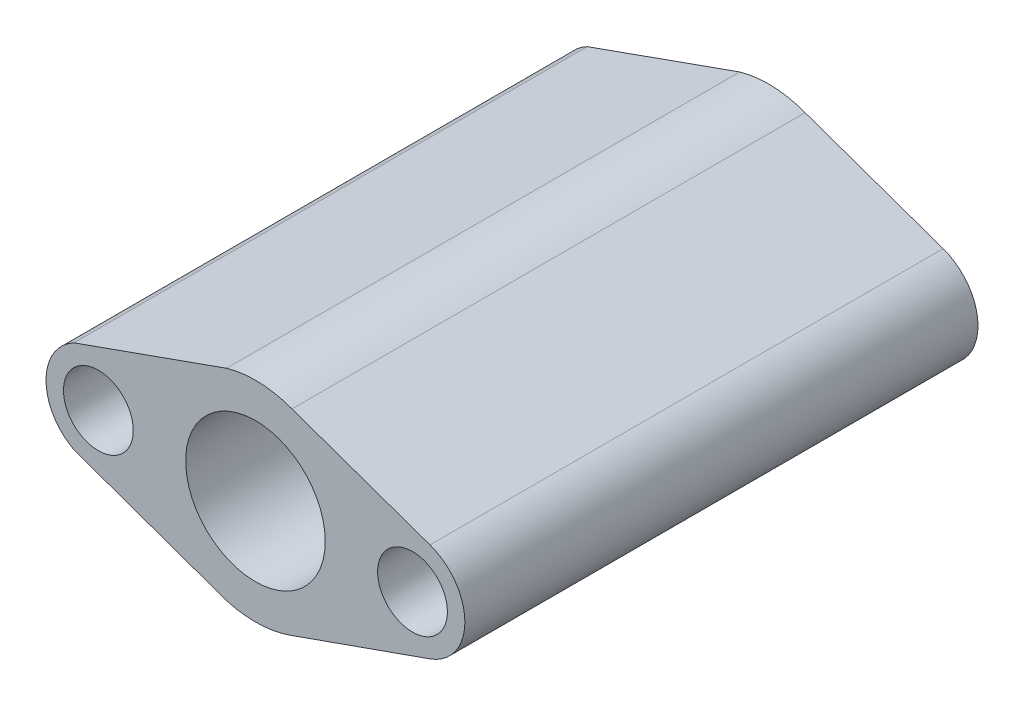
ISO-10303-21;
HEADER;
FILE_DESCRIPTION(('STEP AP214'),'2;1');
FILE_NAME('part.step','',(''),(''),'','','');
FILE_SCHEMA(('AUTOMOTIVE_DESIGN { 1 0 10303 214 1 1 1 1 }'));
ENDSEC;
DATA;
#1=APPLICATION_CONTEXT('core data for automotive mechanical design processes');
#2=APPLICATION_PROTOCOL_DEFINITION('international standard','automotive_design',2000,#1);
#3=PRODUCT_CONTEXT('',#1,'mechanical');
#4=PRODUCT('Part','Part','',(#3));
#5=PRODUCT_RELATED_PRODUCT_CATEGORY('part','',(#4));
#6=PRODUCT_DEFINITION_FORMATION('','',#4);
#7=PRODUCT_DEFINITION_CONTEXT('part definition',#1,'design');
#8=PRODUCT_DEFINITION('design','',#6,#7);
#9=PRODUCT_DEFINITION_SHAPE('','',#8);
#10=(LENGTH_UNIT() NAMED_UNIT(*) SI_UNIT(.MILLI.,.METRE.));
#11=(NAMED_UNIT(*) PLANE_ANGLE_UNIT() SI_UNIT($,.RADIAN.));
#12=(NAMED_UNIT(*) SI_UNIT($,.STERADIAN.) SOLID_ANGLE_UNIT());
#13=UNCERTAINTY_MEASURE_WITH_UNIT(LENGTH_MEASURE(1.E-05),#10,'distance_accuracy_value','');
#14=(GEOMETRIC_REPRESENTATION_CONTEXT(3) GLOBAL_UNCERTAINTY_ASSIGNED_CONTEXT((#13)) GLOBAL_UNIT_ASSIGNED_CONTEXT((#10,
#11,#12)) REPRESENTATION_CONTEXT('',''));
#15=CARTESIAN_POINT('',(0.,0.,0.));
#16=DIRECTION('',(0.,0.,1.));
#17=DIRECTION('',(1.,0.,0.));
#18=AXIS2_PLACEMENT_3D('',#15,#16,#17);
#19=CARTESIAN_POINT('',(23.7236194650575,67.1226286375755,-147.));
#20=DIRECTION('',(-0.333235773660931,-0.942843528456658,0.));
#21=DIRECTION('',(0.942843528456658,-0.333235773660931,0.));
#22=AXIS2_PLACEMENT_3D('',#19,#20,#21);
#23=PLANE('',#22);
#24=DIRECTION('',(0.942843528456658,-0.333235773660931,0.));
#25=VECTOR('',#24,1.);
#26=CARTESIAN_POINT('',(23.7236194650575,67.1226286375755,0.));
#27=LINE('',#26,#25);
#28=CARTESIAN_POINT('',(-36.5083849314917,88.4108466487737,0.));
#29=VERTEX_POINT('',#28);
#30=CARTESIAN_POINT('',(3.01065796299276,74.4433552932996,0.));
#31=VERTEX_POINT('',#30);
#32=EDGE_CURVE('E157',#29,#31,#27,.T.);
#33=ORIENTED_EDGE('',*,*,#32,.T.);
#34=DIRECTION('',(0.,0.,1.));
#35=VECTOR('',#34,1.);
#36=CARTESIAN_POINT('',(3.01065796299276,74.4433552932996,-147.));
#37=LINE('',#36,#35);
#38=CARTESIAN_POINT('',(3.01065796299276,74.4433552932996,-147.));
#39=VERTEX_POINT('',#38);
#40=EDGE_CURVE('E11',#39,#31,#37,.T.);
#41=ORIENTED_EDGE('',*,*,#40,.F.);
#42=DIRECTION('',(0.942843528456658,-0.333235773660931,0.));
#43=VECTOR('',#42,1.);
#44=CARTESIAN_POINT('',(23.7236194650575,67.1226286375755,-147.));
#45=LINE('',#44,#43);
#46=CARTESIAN_POINT('',(-36.5083849314917,88.4108466487737,-147.));
#47=VERTEX_POINT('',#46);
#48=EDGE_CURVE('E61',#47,#39,#45,.T.);
#49=ORIENTED_EDGE('',*,*,#48,.F.);
#50=DIRECTION('',(0.,0.,1.));
#51=VECTOR('',#50,1.);
#52=CARTESIAN_POINT('',(-36.5083849314917,88.4108466487737,-147.));
#53=LINE('',#52,#51);
#54=EDGE_CURVE('E45',#47,#29,#53,.T.);
#55=ORIENTED_EDGE('',*,*,#54,.T.);
#56=EDGE_LOOP('',(#33,#41,#49,#55));
#57=FACE_BOUND('',#56,.T.);
#58=ADVANCED_FACE('F41',(#57),#23,.F.);
#59=CARTESIAN_POINT('',(-1.9878786419212,60.3007023664498,-147.));
#60=DIRECTION('',(0.,0.,1.));
#61=DIRECTION('',(1.,0.,0.));
#62=AXIS2_PLACEMENT_3D('',#59,#60,#61);
#63=CYLINDRICAL_SURFACE('',#62,15.);
#64=CARTESIAN_POINT('',(-1.9878786419212,60.3007023664498,0.));
#65=DIRECTION('',(0.,0.,1.));
#66=DIRECTION('',(1.,0.,0.));
#67=AXIS2_PLACEMENT_3D('',#64,#65,#66);
#68=CIRCLE('',#67,15.);
#69=CARTESIAN_POINT('',(3.01065796299273,46.1580494395999,0.));
#70=VERTEX_POINT('',#69);
#71=EDGE_CURVE('E180',#70,#31,#68,.T.);
#72=ORIENTED_EDGE('',*,*,#71,.F.);
#73=DIRECTION('',(0.,0.,1.));
#74=VECTOR('',#73,1.);
#75=CARTESIAN_POINT('',(3.01065796299273,46.1580494395999,-147.));
#76=LINE('',#75,#74);
#77=CARTESIAN_POINT('',(3.01065796299273,46.1580494395999,-147.));
#78=VERTEX_POINT('',#77);
#79=EDGE_CURVE('E52',#78,#70,#76,.T.);
#80=ORIENTED_EDGE('',*,*,#79,.F.);
#81=CARTESIAN_POINT('',(-1.9878786419212,60.3007023664498,-147.));
#82=DIRECTION('',(0.,0.,1.));
#83=DIRECTION('',(1.,0.,0.));
#84=AXIS2_PLACEMENT_3D('',#81,#82,#83);
#85=CIRCLE('',#84,15.);
#86=EDGE_CURVE('E131',#78,#39,#85,.T.);
#87=ORIENTED_EDGE('',*,*,#86,.T.);
#88=ORIENTED_EDGE('',*,*,#40,.T.);
#89=EDGE_LOOP('',(#72,#80,#87,#88));
#90=FACE_BOUND('',#89,.T.);
#91=ADVANCED_FACE('F218',(#90),#63,.T.);
#92=CARTESIAN_POINT('',(-14.1680385200008,40.0864627550445,-147.));
#93=DIRECTION('',(0.333235773660931,-0.942843528456658,0.));
#94=DIRECTION('',(0.942843528456658,0.333235773660931,0.));
#95=AXIS2_PLACEMENT_3D('',#92,#93,#94);
#96=PLANE('',#95);
#97=DIRECTION('',(0.942843528456658,0.333235773660931,0.));
#98=VECTOR('',#97,1.);
#99=CARTESIAN_POINT('',(-14.1680385200008,40.0864627550445,0.));
#100=LINE('',#99,#98);
#101=CARTESIAN_POINT('',(-36.5083849314917,32.1905580841258,0.));
#102=VERTEX_POINT('',#101);
#103=EDGE_CURVE('E118',#102,#70,#100,.T.);
#104=ORIENTED_EDGE('',*,*,#103,.F.);
#105=DIRECTION('',(0.,0.,1.));
#106=VECTOR('',#105,1.);
#107=CARTESIAN_POINT('',(-36.5083849314917,32.1905580841258,-147.));
#108=LINE('',#107,#106);
#109=CARTESIAN_POINT('',(-36.5083849314917,32.1905580841258,-147.));
#110=VERTEX_POINT('',#109);
#111=EDGE_CURVE('E114',#110,#102,#108,.T.);
#112=ORIENTED_EDGE('',*,*,#111,.F.);
#113=DIRECTION('',(0.942843528456658,0.333235773660931,0.));
#114=VECTOR('',#113,1.);
#115=CARTESIAN_POINT('',(-14.1680385200008,40.0864627550445,-147.));
#116=LINE('',#115,#114);
#117=EDGE_CURVE('E117',#110,#78,#116,.T.);
#118=ORIENTED_EDGE('',*,*,#117,.T.);
#119=ORIENTED_EDGE('',*,*,#79,.T.);
#120=EDGE_LOOP('',(#104,#112,#118,#119));
#121=FACE_BOUND('',#120,.T.);
#122=ADVANCED_FACE('F116',(#121),#96,.T.);
#123=CARTESIAN_POINT('',(-46.9878786419212,60.3007023664498,-147.));
#124=DIRECTION('',(0.,0.,1.));
#125=DIRECTION('',(1.,0.,0.));
#126=AXIS2_PLACEMENT_3D('',#123,#124,#125);
#127=CYLINDRICAL_SURFACE('',#126,30.);
#128=CARTESIAN_POINT('',(-46.9878786419212,60.3007023664498,0.));
#129=DIRECTION('',(0.,0.,1.));
#130=DIRECTION('',(1.,0.,0.));
#131=AXIS2_PLACEMENT_3D('',#128,#129,#130);
#132=CIRCLE('',#131,30.);
#133=CARTESIAN_POINT('',(-55.2521985402417,31.46147532032,0.));
#134=VERTEX_POINT('',#133);
#135=EDGE_CURVE('E175',#134,#102,#132,.T.);
#136=ORIENTED_EDGE('',*,*,#135,.F.);
#137=DIRECTION('',(0.,0.,1.));
#138=VECTOR('',#137,1.);
#139=CARTESIAN_POINT('',(-55.2521985402417,31.46147532032,-147.));
#140=LINE('',#139,#138);
#141=CARTESIAN_POINT('',(-55.2521985402417,31.46147532032,-147.));
#142=VERTEX_POINT('',#141);
#143=EDGE_CURVE('E124',#142,#134,#140,.T.);
#144=ORIENTED_EDGE('',*,*,#143,.F.);
#145=CARTESIAN_POINT('',(-46.9878786419212,60.3007023664498,-147.));
#146=DIRECTION('',(0.,0.,1.));
#147=DIRECTION('',(1.,0.,0.));
#148=AXIS2_PLACEMENT_3D('',#145,#146,#147);
#149=CIRCLE('',#148,30.);
#150=EDGE_CURVE('E129',#142,#110,#149,.T.);
#151=ORIENTED_EDGE('',*,*,#150,.T.);
#152=ORIENTED_EDGE('',*,*,#111,.T.);
#153=EDGE_LOOP('',(#136,#144,#151,#152));
#154=FACE_BOUND('',#153,.T.);
#155=ADVANCED_FACE('F134',(#154),#127,.T.);
#156=CARTESIAN_POINT('',(3.72695572241135,10.4730375117491,-147.));
#157=DIRECTION('',(-0.335265933442933,-0.942123534295073,0.));
#158=DIRECTION('',(0.942123534295073,-0.335265933442933,0.));
#159=AXIS2_PLACEMENT_3D('',#156,#157,#158);
#160=PLANE('',#159);
#161=DIRECTION('',(0.942123534295073,-0.335265933442933,0.));
#162=VECTOR('',#161,1.);
#163=CARTESIAN_POINT('',(3.72695572241135,10.4730375117491,0.));
#164=LINE('',#163,#162);
#165=CARTESIAN_POINT('',(-98.9355184445473,47.006707437424,0.));
#166=VERTEX_POINT('',#165);
#167=EDGE_CURVE('E171',#166,#134,#164,.T.);
#168=ORIENTED_EDGE('',*,*,#167,.F.);
#169=DIRECTION('',(0.,0.,1.));
#170=VECTOR('',#169,1.);
#171=CARTESIAN_POINT('',(-98.9355184445473,47.006707437424,-147.));
#172=LINE('',#171,#170);
#173=CARTESIAN_POINT('',(-98.9355184445473,47.006707437424,-147.));
#174=VERTEX_POINT('',#173);
#175=EDGE_CURVE('E189',#174,#166,#172,.T.);
#176=ORIENTED_EDGE('',*,*,#175,.F.);
#177=DIRECTION('',(0.942123534295073,-0.335265933442933,0.));
#178=VECTOR('',#177,1.);
#179=CARTESIAN_POINT('',(3.72695572241135,10.4730375117491,-147.));
#180=LINE('',#179,#178);
#181=EDGE_CURVE('E136',#174,#142,#180,.T.);
#182=ORIENTED_EDGE('',*,*,#181,.T.);
#183=ORIENTED_EDGE('',*,*,#143,.T.);
#184=EDGE_LOOP('',(#168,#176,#182,#183));
#185=FACE_BOUND('',#184,.T.);
#186=ADVANCED_FACE('F251',(#185),#160,.T.);
#187=CARTESIAN_POINT('',(-91.9878786419212,60.3007023664498,-147.));
#188=DIRECTION('',(0.,0.,1.));
#189=DIRECTION('',(1.,0.,0.));
#190=AXIS2_PLACEMENT_3D('',#187,#188,#189);
#191=CYLINDRICAL_SURFACE('',#190,15.);
#192=CARTESIAN_POINT('',(-91.9878786419212,60.3007023664498,0.));
#193=DIRECTION('',(0.,0.,1.));
#194=DIRECTION('',(1.,0.,0.));
#195=AXIS2_PLACEMENT_3D('',#192,#193,#194);
#196=CIRCLE('',#195,15.);
#197=CARTESIAN_POINT('',(-98.9355184445474,73.5946972954756,0.));
#198=VERTEX_POINT('',#197);
#199=EDGE_CURVE('E168',#166,#198,#196,.F.);
#200=ORIENTED_EDGE('',*,*,#199,.T.);
#201=DIRECTION('',(0.,0.,1.));
#202=VECTOR('',#201,1.);
#203=CARTESIAN_POINT('',(-98.9355184445474,73.5946972954756,-147.));
#204=LINE('',#203,#202);
#205=CARTESIAN_POINT('',(-98.9355184445474,73.5946972954756,-147.));
#206=VERTEX_POINT('',#205);
#207=EDGE_CURVE('E192',#206,#198,#204,.T.);
#208=ORIENTED_EDGE('',*,*,#207,.F.);
#209=CARTESIAN_POINT('',(-91.9878786419212,60.3007023664498,-147.));
#210=DIRECTION('',(0.,0.,1.));
#211=DIRECTION('',(1.,0.,0.));
#212=AXIS2_PLACEMENT_3D('',#209,#210,#211);
#213=CIRCLE('',#212,15.);
#214=EDGE_CURVE('E139',#174,#206,#213,.F.);
#215=ORIENTED_EDGE('',*,*,#214,.F.);
#216=ORIENTED_EDGE('',*,*,#175,.T.);
#217=EDGE_LOOP('',(#200,#208,#215,#216));
#218=FACE_BOUND('',#217,.T.);
#219=ADVANCED_FACE('F254',(#218),#191,.T.);
#220=CARTESIAN_POINT('',(-34.3664362721935,96.5723778416529,-147.));
#221=DIRECTION('',(0.335265933442932,-0.942123534295073,0.));
#222=DIRECTION('',(0.942123534295073,0.335265933442933,0.));
#223=AXIS2_PLACEMENT_3D('',#220,#221,#222);
#224=PLANE('',#223);
#225=DIRECTION('',(0.942123534295073,0.335265933442933,0.));
#226=VECTOR('',#225,1.);
#227=CARTESIAN_POINT('',(-34.3664362721935,96.5723778416529,0.));
#228=LINE('',#227,#226);
#229=CARTESIAN_POINT('',(-55.2521985402417,89.1399294125796,0.));
#230=VERTEX_POINT('',#229);
#231=EDGE_CURVE('E164',#198,#230,#228,.T.);
#232=ORIENTED_EDGE('',*,*,#231,.T.);
#233=DIRECTION('',(0.,0.,1.));
#234=VECTOR('',#233,1.);
#235=CARTESIAN_POINT('',(-55.2521985402417,89.1399294125796,-147.));
#236=LINE('',#235,#234);
#237=CARTESIAN_POINT('',(-55.2521985402417,89.1399294125796,-147.));
#238=VERTEX_POINT('',#237);
#239=EDGE_CURVE('E195',#238,#230,#236,.T.);
#240=ORIENTED_EDGE('',*,*,#239,.F.);
#241=DIRECTION('',(0.942123534295073,0.335265933442933,0.));
#242=VECTOR('',#241,1.);
#243=CARTESIAN_POINT('',(-34.3664362721935,96.5723778416529,-147.));
#244=LINE('',#243,#242);
#245=EDGE_CURVE('E267',#206,#238,#244,.T.);
#246=ORIENTED_EDGE('',*,*,#245,.F.);
#247=ORIENTED_EDGE('',*,*,#207,.T.);
#248=EDGE_LOOP('',(#232,#240,#246,#247));
#249=FACE_BOUND('',#248,.T.);
#250=ADVANCED_FACE('F226',(#249),#224,.F.);
#251=CARTESIAN_POINT('',(-46.9878786419212,60.3007023664498,-147.));
#252=DIRECTION('',(0.,0.,1.));
#253=DIRECTION('',(1.,0.,0.));
#254=AXIS2_PLACEMENT_3D('',#251,#252,#253);
#255=CYLINDRICAL_SURFACE('',#254,20.);
#256=CARTESIAN_POINT('',(-46.9878786419212,60.3007023664498,-147.));
#257=DIRECTION('',(0.,0.,1.));
#258=DIRECTION('',(1.,0.,0.));
#259=AXIS2_PLACEMENT_3D('',#256,#257,#258);
#260=CIRCLE('',#259,20.);
#261=CARTESIAN_POINT('',(-26.9878786419212,60.3007023664498,-147.));
#262=VERTEX_POINT('',#261);
#263=EDGE_CURVE('E277',#262,#262,#260,.T.);
#264=ORIENTED_EDGE('',*,*,#263,.F.);
#265=EDGE_LOOP('',(#264));
#266=FACE_BOUND('',#265,.T.);
#267=CARTESIAN_POINT('',(-46.9878786419212,60.3007023664498,0.));
#268=DIRECTION('',(0.,0.,1.));
#269=DIRECTION('',(1.,0.,0.));
#270=AXIS2_PLACEMENT_3D('',#267,#268,#269);
#271=CIRCLE('',#270,20.);
#272=CARTESIAN_POINT('',(-26.9878786419212,60.3007023664498,0.));
#273=VERTEX_POINT('',#272);
#274=EDGE_CURVE('E153',#273,#273,#271,.T.);
#275=ORIENTED_EDGE('',*,*,#274,.T.);
#276=EDGE_LOOP('',(#275));
#277=FACE_BOUND('',#276,.T.);
#278=ADVANCED_FACE('F224',(#266,#277),#255,.F.);
#279=CARTESIAN_POINT('',(-1.9878786419212,60.3007023664498,-147.));
#280=DIRECTION('',(0.,0.,1.));
#281=DIRECTION('',(1.,0.,0.));
#282=AXIS2_PLACEMENT_3D('',#279,#280,#281);
#283=CYLINDRICAL_SURFACE('',#282,10.);
#284=CARTESIAN_POINT('',(-1.9878786419212,60.3007023664498,-147.));
#285=DIRECTION('',(0.,0.,1.));
#286=DIRECTION('',(1.,0.,0.));
#287=AXIS2_PLACEMENT_3D('',#284,#285,#286);
#288=CIRCLE('',#287,10.);
#289=CARTESIAN_POINT('',(8.0121213580788,60.3007023664498,-147.));
#290=VERTEX_POINT('',#289);
#291=EDGE_CURVE('E235',#290,#290,#288,.T.);
#292=ORIENTED_EDGE('',*,*,#291,.F.);
#293=EDGE_LOOP('',(#292));
#294=FACE_BOUND('',#293,.T.);
#295=CARTESIAN_POINT('',(-1.9878786419212,60.3007023664498,0.));
#296=DIRECTION('',(0.,0.,1.));
#297=DIRECTION('',(1.,0.,0.));
#298=AXIS2_PLACEMENT_3D('',#295,#296,#297);
#299=CIRCLE('',#298,10.);
#300=CARTESIAN_POINT('',(8.0121213580788,60.3007023664498,0.));
#301=VERTEX_POINT('',#300);
#302=EDGE_CURVE('E149',#301,#301,#299,.T.);
#303=ORIENTED_EDGE('',*,*,#302,.T.);
#304=EDGE_LOOP('',(#303));
#305=FACE_BOUND('',#304,.T.);
#306=ADVANCED_FACE('F213',(#294,#305),#283,.F.);
#307=CARTESIAN_POINT('',(-91.9878786419212,60.3007023664498,-147.));
#308=DIRECTION('',(0.,0.,1.));
#309=DIRECTION('',(1.,0.,0.));
#310=AXIS2_PLACEMENT_3D('',#307,#308,#309);
#311=CYLINDRICAL_SURFACE('',#310,10.);
#312=CARTESIAN_POINT('',(-91.9878786419212,60.3007023664498,-147.));
#313=DIRECTION('',(0.,0.,1.));
#314=DIRECTION('',(1.,0.,0.));
#315=AXIS2_PLACEMENT_3D('',#312,#313,#314);
#316=CIRCLE('',#315,10.);
#317=CARTESIAN_POINT('',(-81.9878786419212,60.3007023664498,-147.));
#318=VERTEX_POINT('',#317);
#319=EDGE_CURVE('E183',#318,#318,#316,.F.);
#320=ORIENTED_EDGE('',*,*,#319,.T.);
#321=EDGE_LOOP('',(#320));
#322=FACE_BOUND('',#321,.T.);
#323=CARTESIAN_POINT('',(-91.9878786419212,60.3007023664498,0.));
#324=DIRECTION('',(0.,0.,1.));
#325=DIRECTION('',(1.,0.,0.));
#326=AXIS2_PLACEMENT_3D('',#323,#324,#325);
#327=CIRCLE('',#326,10.);
#328=CARTESIAN_POINT('',(-81.9878786419212,60.3007023664498,0.));
#329=VERTEX_POINT('',#328);
#330=EDGE_CURVE('E145',#329,#329,#327,.F.);
#331=ORIENTED_EDGE('',*,*,#330,.F.);
#332=EDGE_LOOP('',(#331));
#333=FACE_BOUND('',#332,.T.);
#334=ADVANCED_FACE('F43',(#322,#333),#311,.F.);
#335=CARTESIAN_POINT('',(-46.9878786419212,60.3007023664498,-147.));
#336=DIRECTION('',(0.,0.,1.));
#337=DIRECTION('',(1.,0.,0.));
#338=AXIS2_PLACEMENT_3D('',#335,#336,#337);
#339=CYLINDRICAL_SURFACE('',#338,30.);
#340=CARTESIAN_POINT('',(-46.9878786419212,60.3007023664498,0.));
#341=DIRECTION('',(0.,0.,1.));
#342=DIRECTION('',(1.,0.,0.));
#343=AXIS2_PLACEMENT_3D('',#340,#341,#342);
#344=CIRCLE('',#343,30.);
#345=EDGE_CURVE('E160',#29,#230,#344,.T.);
#346=ORIENTED_EDGE('',*,*,#345,.F.);
#347=ORIENTED_EDGE('',*,*,#54,.F.);
#348=CARTESIAN_POINT('',(-46.9878786419212,60.3007023664498,-147.));
#349=DIRECTION('',(0.,0.,1.));
#350=DIRECTION('',(1.,0.,0.));
#351=AXIS2_PLACEMENT_3D('',#348,#349,#350);
#352=CIRCLE('',#351,30.);
#353=EDGE_CURVE('E270',#47,#238,#352,.T.);
#354=ORIENTED_EDGE('',*,*,#353,.T.);
#355=ORIENTED_EDGE('',*,*,#239,.T.);
#356=EDGE_LOOP('',(#346,#347,#354,#355));
#357=FACE_BOUND('',#356,.T.);
#358=ADVANCED_FACE('F204',(#357),#339,.T.);
#359=CARTESIAN_POINT('',(0.,0.,-147.));
#360=DIRECTION('',(0.,0.,1.));
#361=DIRECTION('',(1.,0.,0.));
#362=AXIS2_PLACEMENT_3D('',#359,#360,#361);
#363=PLANE('',#362);
#364=ORIENTED_EDGE('',*,*,#319,.F.);
#365=EDGE_LOOP('',(#364));
#366=FACE_BOUND('',#365,.T.);
#367=ORIENTED_EDGE('',*,*,#291,.T.);
#368=EDGE_LOOP('',(#367));
#369=FACE_BOUND('',#368,.T.);
#370=ORIENTED_EDGE('',*,*,#263,.T.);
#371=EDGE_LOOP('',(#370));
#372=FACE_BOUND('',#371,.T.);
#373=ORIENTED_EDGE('',*,*,#48,.T.);
#374=ORIENTED_EDGE('',*,*,#86,.F.);
#375=ORIENTED_EDGE('',*,*,#117,.F.);
#376=ORIENTED_EDGE('',*,*,#150,.F.);
#377=ORIENTED_EDGE('',*,*,#181,.F.);
#378=ORIENTED_EDGE('',*,*,#214,.T.);
#379=ORIENTED_EDGE('',*,*,#245,.T.);
#380=ORIENTED_EDGE('',*,*,#353,.F.);
#381=EDGE_LOOP('',(#373,#374,#375,#376,#377,#378,#379,#380));
#382=FACE_BOUND('',#381,.T.);
#383=ADVANCED_FACE('F127',(#366,#369,#372,#382),#363,.F.);
#384=CARTESIAN_POINT('',(0.,0.,0.));
#385=DIRECTION('',(0.,0.,1.));
#386=DIRECTION('',(1.,0.,0.));
#387=AXIS2_PLACEMENT_3D('',#384,#385,#386);
#388=PLANE('',#387);
#389=ORIENTED_EDGE('',*,*,#330,.T.);
#390=EDGE_LOOP('',(#389));
#391=FACE_BOUND('',#390,.T.);
#392=ORIENTED_EDGE('',*,*,#302,.F.);
#393=EDGE_LOOP('',(#392));
#394=FACE_BOUND('',#393,.T.);
#395=ORIENTED_EDGE('',*,*,#274,.F.);
#396=EDGE_LOOP('',(#395));
#397=FACE_BOUND('',#396,.T.);
#398=ORIENTED_EDGE('',*,*,#32,.F.);
#399=ORIENTED_EDGE('',*,*,#345,.T.);
#400=ORIENTED_EDGE('',*,*,#231,.F.);
#401=ORIENTED_EDGE('',*,*,#199,.F.);
#402=ORIENTED_EDGE('',*,*,#167,.T.);
#403=ORIENTED_EDGE('',*,*,#135,.T.);
#404=ORIENTED_EDGE('',*,*,#103,.T.);
#405=ORIENTED_EDGE('',*,*,#71,.T.);
#406=EDGE_LOOP('',(#398,#399,#400,#401,#402,#403,#404,#405));
#407=FACE_BOUND('',#406,.T.);
#408=ADVANCED_FACE('F202',(#391,#394,#397,#407),#388,.T.);
#409=CLOSED_SHELL('',(#58,#91,#122,#155,#186,#219,#250,#278,#306,#334,#358,#383,#408));
#410=MANIFOLD_SOLID_BREP('B2',#409);
#411=ADVANCED_BREP_SHAPE_REPRESENTATION('',(#18,#410),#14);
#412=SHAPE_DEFINITION_REPRESENTATION(#9,#411);
ENDSEC;
END-ISO-10303-21;
